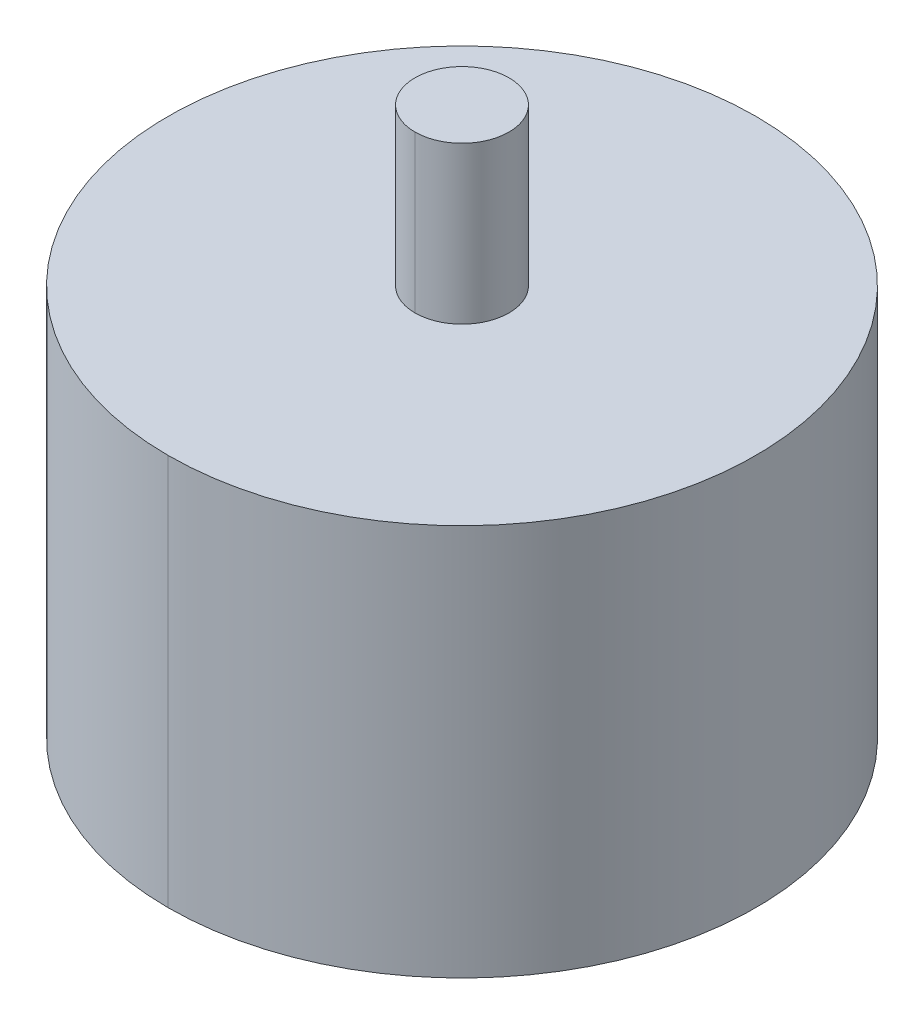
ISO-10303-21;
HEADER;
FILE_DESCRIPTION(('STEP AP214'),'2;1');
FILE_NAME('part.step','',(''),(''),'','','');
FILE_SCHEMA(('AUTOMOTIVE_DESIGN { 1 0 10303 214 1 1 1 1 }'));
ENDSEC;
DATA;
#1=APPLICATION_CONTEXT('core data for automotive mechanical design processes');
#2=APPLICATION_PROTOCOL_DEFINITION('international standard','automotive_design',2000,#1);
#3=PRODUCT_CONTEXT('',#1,'mechanical');
#4=PRODUCT('Part','Part','',(#3));
#5=PRODUCT_RELATED_PRODUCT_CATEGORY('part','',(#4));
#6=PRODUCT_DEFINITION_FORMATION('','',#4);
#7=PRODUCT_DEFINITION_CONTEXT('part definition',#1,'design');
#8=PRODUCT_DEFINITION('design','',#6,#7);
#9=PRODUCT_DEFINITION_SHAPE('','',#8);
#10=(LENGTH_UNIT() NAMED_UNIT(*) SI_UNIT(.MILLI.,.METRE.));
#11=(NAMED_UNIT(*) PLANE_ANGLE_UNIT() SI_UNIT($,.RADIAN.));
#12=(NAMED_UNIT(*) SI_UNIT($,.STERADIAN.) SOLID_ANGLE_UNIT());
#13=UNCERTAINTY_MEASURE_WITH_UNIT(LENGTH_MEASURE(1.E-05),#10,'distance_accuracy_value','');
#14=(GEOMETRIC_REPRESENTATION_CONTEXT(3) GLOBAL_UNCERTAINTY_ASSIGNED_CONTEXT((#13)) GLOBAL_UNIT_ASSIGNED_CONTEXT((#10,
#11,#12)) REPRESENTATION_CONTEXT('',''));
#15=CARTESIAN_POINT('',(0.,0.,0.));
#16=DIRECTION('',(0.,0.,1.));
#17=DIRECTION('',(1.,0.,0.));
#18=AXIS2_PLACEMENT_3D('',#15,#16,#17);
#19=CARTESIAN_POINT('',(0.,70.,0.));
#20=DIRECTION('',(0.,-1.,0.));
#21=DIRECTION('',(0.,0.,-1.));
#22=AXIS2_PLACEMENT_3D('',#19,#20,#21);
#23=CYLINDRICAL_SURFACE('',#22,6.);
#24=CARTESIAN_POINT('',(0.,70.,0.));
#25=DIRECTION('',(0.,1.,0.));
#26=DIRECTION('',(0.,0.,1.));
#27=AXIS2_PLACEMENT_3D('',#24,#25,#26);
#28=CIRCLE('',#27,6.);
#29=CARTESIAN_POINT('',(0.,70.,6.));
#30=VERTEX_POINT('',#29);
#31=CARTESIAN_POINT('',(0.,70.,-6.));
#32=VERTEX_POINT('',#31);
#33=EDGE_CURVE('E20',#30,#32,#28,.T.);
#34=ORIENTED_EDGE('',*,*,#33,.F.);
#35=DIRECTION('',(0.,-1.,0.));
#36=VECTOR('',#35,1.);
#37=CARTESIAN_POINT('',(0.,70.,6.));
#38=LINE('',#37,#36);
#39=CARTESIAN_POINT('',(0.,50.,6.));
#40=VERTEX_POINT('',#39);
#41=EDGE_CURVE('E11',#30,#40,#38,.T.);
#42=ORIENTED_EDGE('',*,*,#41,.T.);
#43=CARTESIAN_POINT('',(0.,50.,0.));
#44=DIRECTION('',(0.,1.,0.));
#45=DIRECTION('',(0.,0.,1.));
#46=AXIS2_PLACEMENT_3D('',#43,#44,#45);
#47=CIRCLE('',#46,6.);
#48=CARTESIAN_POINT('',(0.,50.,-6.));
#49=VERTEX_POINT('',#48);
#50=EDGE_CURVE('E27',#40,#49,#47,.T.);
#51=ORIENTED_EDGE('',*,*,#50,.T.);
#52=DIRECTION('',(0.,-1.,0.));
#53=VECTOR('',#52,1.);
#54=CARTESIAN_POINT('',(0.,70.,-6.));
#55=LINE('',#54,#53);
#56=EDGE_CURVE('E116',#32,#49,#55,.T.);
#57=ORIENTED_EDGE('',*,*,#56,.F.);
#58=EDGE_LOOP('',(#34,#42,#51,#57));
#59=FACE_BOUND('',#58,.T.);
#60=ADVANCED_FACE('F16',(#59),#23,.T.);
#61=CARTESIAN_POINT('',(0.,50.,0.));
#62=DIRECTION('',(0.,-1.,0.));
#63=DIRECTION('',(0.,0.,-1.));
#64=AXIS2_PLACEMENT_3D('',#61,#62,#63);
#65=CYLINDRICAL_SURFACE('',#64,37.5);
#66=CARTESIAN_POINT('',(0.,50.,0.));
#67=DIRECTION('',(0.,1.,0.));
#68=DIRECTION('',(0.,0.,1.));
#69=AXIS2_PLACEMENT_3D('',#66,#67,#68);
#70=CIRCLE('',#69,37.5);
#71=CARTESIAN_POINT('',(0.,50.,37.5));
#72=VERTEX_POINT('',#71);
#73=CARTESIAN_POINT('',(0.,50.,-37.5));
#74=VERTEX_POINT('',#73);
#75=EDGE_CURVE('E69',#72,#74,#70,.T.);
#76=ORIENTED_EDGE('',*,*,#75,.F.);
#77=DIRECTION('',(0.,-1.,0.));
#78=VECTOR('',#77,1.);
#79=CARTESIAN_POINT('',(0.,50.,37.5));
#80=LINE('',#79,#78);
#81=CARTESIAN_POINT('',(0.,0.,37.5));
#82=VERTEX_POINT('',#81);
#83=EDGE_CURVE('E94',#72,#82,#80,.T.);
#84=ORIENTED_EDGE('',*,*,#83,.T.);
#85=CARTESIAN_POINT('',(0.,0.,0.));
#86=DIRECTION('',(0.,1.,0.));
#87=DIRECTION('',(0.,0.,1.));
#88=AXIS2_PLACEMENT_3D('',#85,#86,#87);
#89=CIRCLE('',#88,37.5);
#90=CARTESIAN_POINT('',(0.,0.,-37.5));
#91=VERTEX_POINT('',#90);
#92=EDGE_CURVE('E79',#82,#91,#89,.T.);
#93=ORIENTED_EDGE('',*,*,#92,.T.);
#94=DIRECTION('',(0.,-1.,0.));
#95=VECTOR('',#94,1.);
#96=CARTESIAN_POINT('',(0.,50.,-37.5));
#97=LINE('',#96,#95);
#98=EDGE_CURVE('E86',#74,#91,#97,.T.);
#99=ORIENTED_EDGE('',*,*,#98,.F.);
#100=EDGE_LOOP('',(#76,#84,#93,#99));
#101=FACE_BOUND('',#100,.T.);
#102=ADVANCED_FACE('F93',(#101),#65,.T.);
#103=CARTESIAN_POINT('',(0.,50.,0.));
#104=DIRECTION('',(0.,-1.,0.));
#105=DIRECTION('',(0.,0.,-1.));
#106=AXIS2_PLACEMENT_3D('',#103,#104,#105);
#107=CYLINDRICAL_SURFACE('',#106,37.5);
#108=ORIENTED_EDGE('',*,*,#83,.F.);
#109=CARTESIAN_POINT('',(0.,50.,0.));
#110=DIRECTION('',(0.,1.,0.));
#111=DIRECTION('',(0.,0.,1.));
#112=AXIS2_PLACEMENT_3D('',#109,#110,#111);
#113=CIRCLE('',#112,37.5);
#114=EDGE_CURVE('E90',#74,#72,#113,.T.);
#115=ORIENTED_EDGE('',*,*,#114,.F.);
#116=ORIENTED_EDGE('',*,*,#98,.T.);
#117=CARTESIAN_POINT('',(0.,0.,0.));
#118=DIRECTION('',(0.,1.,0.));
#119=DIRECTION('',(0.,0.,1.));
#120=AXIS2_PLACEMENT_3D('',#117,#118,#119);
#121=CIRCLE('',#120,37.5);
#122=EDGE_CURVE('E88',#91,#82,#121,.T.);
#123=ORIENTED_EDGE('',*,*,#122,.T.);
#124=EDGE_LOOP('',(#108,#115,#116,#123));
#125=FACE_BOUND('',#124,.T.);
#126=ADVANCED_FACE('F87',(#125),#107,.T.);
#127=CARTESIAN_POINT('',(0.,50.,0.));
#128=DIRECTION('',(0.,1.,0.));
#129=DIRECTION('',(1.,0.,0.));
#130=AXIS2_PLACEMENT_3D('',#127,#128,#129);
#131=PLANE('',#130);
#132=ORIENTED_EDGE('',*,*,#114,.T.);
#133=ORIENTED_EDGE('',*,*,#75,.T.);
#134=EDGE_LOOP('',(#132,#133));
#135=FACE_BOUND('',#134,.T.);
#136=CARTESIAN_POINT('',(0.,50.,0.));
#137=DIRECTION('',(0.,1.,0.));
#138=DIRECTION('',(0.,0.,1.));
#139=AXIS2_PLACEMENT_3D('',#136,#137,#138);
#140=CIRCLE('',#139,6.);
#141=EDGE_CURVE('E106',#49,#40,#140,.T.);
#142=ORIENTED_EDGE('',*,*,#141,.F.);
#143=ORIENTED_EDGE('',*,*,#50,.F.);
#144=EDGE_LOOP('',(#142,#143));
#145=FACE_BOUND('',#144,.T.);
#146=ADVANCED_FACE('F146',(#135,#145),#131,.T.);
#147=CARTESIAN_POINT('',(0.,0.,0.));
#148=DIRECTION('',(0.,1.,0.));
#149=DIRECTION('',(1.,0.,0.));
#150=AXIS2_PLACEMENT_3D('',#147,#148,#149);
#151=PLANE('',#150);
#152=ORIENTED_EDGE('',*,*,#122,.F.);
#153=ORIENTED_EDGE('',*,*,#92,.F.);
#154=EDGE_LOOP('',(#152,#153));
#155=FACE_BOUND('',#154,.T.);
#156=ADVANCED_FACE('F97',(#155),#151,.F.);
#157=CARTESIAN_POINT('',(0.,70.,0.));
#158=DIRECTION('',(0.,-1.,0.));
#159=DIRECTION('',(0.,0.,-1.));
#160=AXIS2_PLACEMENT_3D('',#157,#158,#159);
#161=CYLINDRICAL_SURFACE('',#160,6.);
#162=ORIENTED_EDGE('',*,*,#41,.F.);
#163=CARTESIAN_POINT('',(0.,70.,0.));
#164=DIRECTION('',(0.,1.,0.));
#165=DIRECTION('',(0.,0.,1.));
#166=AXIS2_PLACEMENT_3D('',#163,#164,#165);
#167=CIRCLE('',#166,6.);
#168=EDGE_CURVE('E108',#32,#30,#167,.T.);
#169=ORIENTED_EDGE('',*,*,#168,.F.);
#170=ORIENTED_EDGE('',*,*,#56,.T.);
#171=ORIENTED_EDGE('',*,*,#141,.T.);
#172=EDGE_LOOP('',(#162,#169,#170,#171));
#173=FACE_BOUND('',#172,.T.);
#174=ADVANCED_FACE('F18',(#173),#161,.T.);
#175=CARTESIAN_POINT('',(0.,70.,0.));
#176=DIRECTION('',(0.,1.,0.));
#177=DIRECTION('',(1.,0.,0.));
#178=AXIS2_PLACEMENT_3D('',#175,#176,#177);
#179=PLANE('',#178);
#180=ORIENTED_EDGE('',*,*,#168,.T.);
#181=ORIENTED_EDGE('',*,*,#33,.T.);
#182=EDGE_LOOP('',(#180,#181));
#183=FACE_BOUND('',#182,.T.);
#184=ADVANCED_FACE('F154',(#183),#179,.T.);
#185=CLOSED_SHELL('',(#60,#102,#126,#146,#156,#174,#184));
#186=MANIFOLD_SOLID_BREP('B1',#185);
#187=ADVANCED_BREP_SHAPE_REPRESENTATION('',(#18,#186),#14);
#188=SHAPE_DEFINITION_REPRESENTATION(#9,#187);
ENDSEC;
END-ISO-10303-21;
